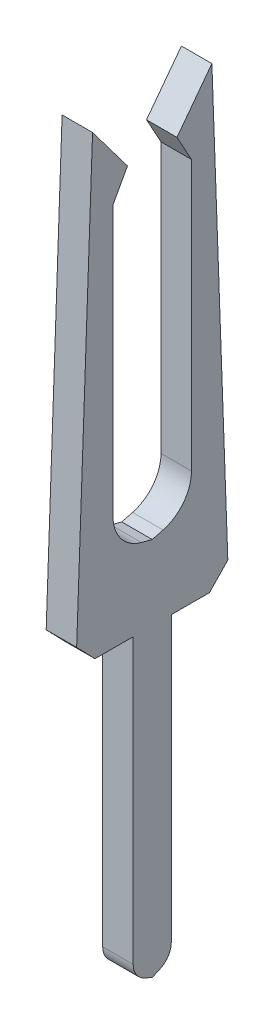
ISO-10303-21;
HEADER;
FILE_DESCRIPTION(('STEP AP214'),'2;1');
FILE_NAME('part.step','',(''),(''),'','','');
FILE_SCHEMA(('AUTOMOTIVE_DESIGN { 1 0 10303 214 1 1 1 1 }'));
ENDSEC;
DATA;
#1=APPLICATION_CONTEXT('core data for automotive mechanical design processes');
#2=APPLICATION_PROTOCOL_DEFINITION('international standard','automotive_design',2000,#1);
#3=PRODUCT_CONTEXT('',#1,'mechanical');
#4=PRODUCT('Part','Part','',(#3));
#5=PRODUCT_RELATED_PRODUCT_CATEGORY('part','',(#4));
#6=PRODUCT_DEFINITION_FORMATION('','',#4);
#7=PRODUCT_DEFINITION_CONTEXT('part definition',#1,'design');
#8=PRODUCT_DEFINITION('design','',#6,#7);
#9=PRODUCT_DEFINITION_SHAPE('','',#8);
#10=(LENGTH_UNIT() NAMED_UNIT(*) SI_UNIT(.MILLI.,.METRE.));
#11=(NAMED_UNIT(*) PLANE_ANGLE_UNIT() SI_UNIT($,.RADIAN.));
#12=(NAMED_UNIT(*) SI_UNIT($,.STERADIAN.) SOLID_ANGLE_UNIT());
#13=UNCERTAINTY_MEASURE_WITH_UNIT(LENGTH_MEASURE(1.E-05),#10,'distance_accuracy_value','');
#14=(GEOMETRIC_REPRESENTATION_CONTEXT(3) GLOBAL_UNCERTAINTY_ASSIGNED_CONTEXT((#13)) GLOBAL_UNIT_ASSIGNED_CONTEXT((#10,
#11,#12)) REPRESENTATION_CONTEXT('',''));
#15=CARTESIAN_POINT('',(0.,0.,0.));
#16=DIRECTION('',(0.,0.,1.));
#17=DIRECTION('',(1.,0.,0.));
#18=AXIS2_PLACEMENT_3D('',#15,#16,#17);
#19=CARTESIAN_POINT('',(0.4,2.15627423693323,0.277438328452502));
#20=DIRECTION('',(0.,0.694137309805425,0.71984261831048));
#21=DIRECTION('',(0.,-0.71984261831048,0.694137309805425));
#22=AXIS2_PLACEMENT_3D('',#19,#20,#21);
#23=PLANE('',#22);
#24=DIRECTION('',(0.,0.71984261831048,-0.694137309805425));
#25=VECTOR('',#24,1.);
#26=CARTESIAN_POINT('',(0.,2.15627423693323,0.277438328452502));
#27=LINE('',#26,#25);
#28=CARTESIAN_POINT('',(0.,1.90643942765456,0.518351630884458));
#29=VERTEX_POINT('',#28);
#30=CARTESIAN_POINT('',(0.,2.15627423693323,0.277438328452502));
#31=VERTEX_POINT('',#30);
#32=EDGE_CURVE('E222',#29,#31,#27,.T.);
#33=ORIENTED_EDGE('',*,*,#32,.T.);
#34=DIRECTION('',(-1.,0.,0.));
#35=VECTOR('',#34,1.);
#36=CARTESIAN_POINT('',(0.4,2.15627423693323,0.277438328452502));
#37=LINE('',#36,#35);
#38=CARTESIAN_POINT('',(0.4,2.15627423693323,0.277438328452502));
#39=VERTEX_POINT('',#38);
#40=EDGE_CURVE('E11',#39,#31,#37,.T.);
#41=ORIENTED_EDGE('',*,*,#40,.F.);
#42=DIRECTION('',(0.,0.71984261831048,-0.694137309805425));
#43=VECTOR('',#42,1.);
#44=CARTESIAN_POINT('',(0.4,2.15627423693323,0.277438328452502));
#45=LINE('',#44,#43);
#46=CARTESIAN_POINT('',(0.4,1.90643942765456,0.518351630884458));
#47=VERTEX_POINT('',#46);
#48=EDGE_CURVE('E268',#47,#39,#45,.T.);
#49=ORIENTED_EDGE('',*,*,#48,.F.);
#50=DIRECTION('',(-1.,0.,0.));
#51=VECTOR('',#50,1.);
#52=CARTESIAN_POINT('',(0.4,1.90643942765456,0.518351630884458));
#53=LINE('',#52,#51);
#54=EDGE_CURVE('E218',#47,#29,#53,.T.);
#55=ORIENTED_EDGE('',*,*,#54,.T.);
#56=EDGE_LOOP('',(#33,#41,#49,#55));
#57=FACE_BOUND('',#56,.T.);
#58=ADVANCED_FACE('F38',(#57),#23,.F.);
#59=CARTESIAN_POINT('',(0.4,7.90643942765456,0.486576567456251));
#60=DIRECTION('',(0.,-0.036346790272175,0.99933923711466));
#61=DIRECTION('',(0.,-0.99933923711466,-0.036346790272175));
#62=AXIS2_PLACEMENT_3D('',#59,#60,#61);
#63=PLANE('',#62);
#64=DIRECTION('',(0.,0.99933923711466,0.036346790272175));
#65=VECTOR('',#64,1.);
#66=CARTESIAN_POINT('',(0.,7.90643942765456,0.486576567456251));
#67=LINE('',#66,#65);
#68=CARTESIAN_POINT('',(0.,7.90643942765456,0.486576567456251));
#69=VERTEX_POINT('',#68);
#70=EDGE_CURVE('E225',#31,#69,#67,.T.);
#71=ORIENTED_EDGE('',*,*,#70,.T.);
#72=DIRECTION('',(-1.,0.,0.));
#73=VECTOR('',#72,1.);
#74=CARTESIAN_POINT('',(0.4,7.90643942765456,0.486576567456251));
#75=LINE('',#74,#73);
#76=CARTESIAN_POINT('',(0.4,7.90643942765456,0.486576567456251));
#77=VERTEX_POINT('',#76);
#78=EDGE_CURVE('E46',#77,#69,#75,.T.);
#79=ORIENTED_EDGE('',*,*,#78,.F.);
#80=DIRECTION('',(0.,0.99933923711466,0.036346790272175));
#81=VECTOR('',#80,1.);
#82=CARTESIAN_POINT('',(0.4,7.90643942765456,0.486576567456251));
#83=LINE('',#82,#81);
#84=EDGE_CURVE('E141',#39,#77,#83,.T.);
#85=ORIENTED_EDGE('',*,*,#84,.F.);
#86=ORIENTED_EDGE('',*,*,#40,.T.);
#87=EDGE_LOOP('',(#71,#79,#85,#86));
#88=FACE_BOUND('',#87,.T.);
#89=ADVANCED_FACE('F402',(#88),#63,.F.);
#90=CARTESIAN_POINT('',(0.4,7.29691604158744,0.944947879463951));
#91=DIRECTION('',(0.,-0.601030672473663,-0.799225957252301));
#92=DIRECTION('',(0.,0.799225957252301,-0.601030672473663));
#93=AXIS2_PLACEMENT_3D('',#90,#91,#92);
#94=PLANE('',#93);
#95=DIRECTION('',(0.,-0.799225957252301,0.601030672473663));
#96=VECTOR('',#95,1.);
#97=CARTESIAN_POINT('',(0.,7.29691604158744,0.944947879463951));
#98=LINE('',#97,#96);
#99=CARTESIAN_POINT('',(0.,7.29691604158744,0.944947879463951));
#100=VERTEX_POINT('',#99);
#101=EDGE_CURVE('E228',#69,#100,#98,.T.);
#102=ORIENTED_EDGE('',*,*,#101,.T.);
#103=DIRECTION('',(-1.,0.,0.));
#104=VECTOR('',#103,1.);
#105=CARTESIAN_POINT('',(0.4,7.29691604158744,0.944947879463951));
#106=LINE('',#105,#104);
#107=CARTESIAN_POINT('',(0.4,7.29691604158744,0.944947879463951));
#108=VERTEX_POINT('',#107);
#109=EDGE_CURVE('E318',#108,#100,#106,.T.);
#110=ORIENTED_EDGE('',*,*,#109,.F.);
#111=DIRECTION('',(0.,-0.799225957252301,0.601030672473663));
#112=VECTOR('',#111,1.);
#113=CARTESIAN_POINT('',(0.4,7.29691604158744,0.944947879463951));
#114=LINE('',#113,#112);
#115=EDGE_CURVE('E327',#77,#108,#114,.T.);
#116=ORIENTED_EDGE('',*,*,#115,.F.);
#117=ORIENTED_EDGE('',*,*,#78,.T.);
#118=EDGE_LOOP('',(#102,#110,#116,#117));
#119=FACE_BOUND('',#118,.T.);
#120=ADVANCED_FACE('F325',(#119),#94,.F.);
#121=CARTESIAN_POINT('',(0.4,6.95011825296304,0.754777343997982));
#122=DIRECTION('',(0.,0.480815317239039,-0.876821892238283));
#123=DIRECTION('',(0.,0.876821892238283,0.480815317239039));
#124=AXIS2_PLACEMENT_3D('',#121,#122,#123);
#125=PLANE('',#124);
#126=DIRECTION('',(0.,-0.876821892238283,-0.480815317239039));
#127=VECTOR('',#126,1.);
#128=CARTESIAN_POINT('',(0.,6.95011825296304,0.754777343997982));
#129=LINE('',#128,#127);
#130=CARTESIAN_POINT('',(0.,6.95011825296304,0.754777343997982));
#131=VERTEX_POINT('',#130);
#132=EDGE_CURVE('E231',#100,#131,#129,.T.);
#133=ORIENTED_EDGE('',*,*,#132,.T.);
#134=DIRECTION('',(-1.,0.,0.));
#135=VECTOR('',#134,1.);
#136=CARTESIAN_POINT('',(0.4,6.95011825296304,0.754777343997982));
#137=LINE('',#136,#135);
#138=CARTESIAN_POINT('',(0.4,6.95011825296304,0.754777343997982));
#139=VERTEX_POINT('',#138);
#140=EDGE_CURVE('E314',#139,#131,#137,.T.);
#141=ORIENTED_EDGE('',*,*,#140,.F.);
#142=DIRECTION('',(0.,-0.876821892238283,-0.480815317239039));
#143=VECTOR('',#142,1.);
#144=CARTESIAN_POINT('',(0.4,6.95011825296304,0.754777343997982));
#145=LINE('',#144,#143);
#146=EDGE_CURVE('E346',#108,#139,#145,.T.);
#147=ORIENTED_EDGE('',*,*,#146,.F.);
#148=ORIENTED_EDGE('',*,*,#109,.T.);
#149=EDGE_LOOP('',(#133,#141,#147,#148));
#150=FACE_BOUND('',#149,.T.);
#151=ADVANCED_FACE('F336',(#150),#125,.F.);
#152=CARTESIAN_POINT('',(0.4,3.40759606010662,0.754710604299908));
#153=DIRECTION('',(0.,1.88395991410638E-05,-0.999999999822535));
#154=DIRECTION('',(0.,0.999999999822535,1.88395991410638E-05));
#155=AXIS2_PLACEMENT_3D('',#152,#153,#154);
#156=PLANE('',#155);
#157=DIRECTION('',(0.,-0.999999999822535,-1.88395991410638E-05));
#158=VECTOR('',#157,1.);
#159=CARTESIAN_POINT('',(0.,3.40759606010662,0.754710604299908));
#160=LINE('',#159,#158);
#161=CARTESIAN_POINT('',(0.,3.40759606010662,0.754710604299908));
#162=VERTEX_POINT('',#161);
#163=EDGE_CURVE('E234',#131,#162,#160,.T.);
#164=ORIENTED_EDGE('',*,*,#163,.T.);
#165=DIRECTION('',(-1.,0.,0.));
#166=VECTOR('',#165,1.);
#167=CARTESIAN_POINT('',(0.4,3.40759606010662,0.754710604299908));
#168=LINE('',#167,#166);
#169=CARTESIAN_POINT('',(0.4,3.40759606010662,0.754710604299908));
#170=VERTEX_POINT('',#169);
#171=EDGE_CURVE('E311',#170,#162,#168,.T.);
#172=ORIENTED_EDGE('',*,*,#171,.F.);
#173=DIRECTION('',(0.,-0.999999999822535,-1.88395991410638E-05));
#174=VECTOR('',#173,1.);
#175=CARTESIAN_POINT('',(0.4,3.40759606010662,0.754710604299908));
#176=LINE('',#175,#174);
#177=EDGE_CURVE('E342',#139,#170,#176,.T.);
#178=ORIENTED_EDGE('',*,*,#177,.F.);
#179=ORIENTED_EDGE('',*,*,#140,.T.);
#180=EDGE_LOOP('',(#164,#172,#178,#179));
#181=FACE_BOUND('',#180,.T.);
#182=ADVANCED_FACE('F340',(#181),#156,.F.);
#183=CARTESIAN_POINT('',(0.4,3.40758664030705,1.25471060421118));
#184=DIRECTION('',(-1.,0.,0.));
#185=DIRECTION('',(0.,0.,1.));
#186=AXIS2_PLACEMENT_3D('',#183,#184,#185);
#187=CYLINDRICAL_SURFACE('',#186,0.5);
#188=CARTESIAN_POINT('',(0.,3.40758664030705,1.25471060421118));
#189=DIRECTION('',(-1.,0.,0.));
#190=DIRECTION('',(0.,0.,-1.));
#191=AXIS2_PLACEMENT_3D('',#188,#189,#190);
#192=CIRCLE('',#191,0.5);
#193=CARTESIAN_POINT('',(0.,2.92391221511593,1.127986295509));
#194=VERTEX_POINT('',#193);
#195=EDGE_CURVE('E237',#162,#194,#192,.T.);
#196=ORIENTED_EDGE('',*,*,#195,.T.);
#197=DIRECTION('',(-1.,0.,0.));
#198=VECTOR('',#197,1.);
#199=CARTESIAN_POINT('',(0.4,2.92391221511593,1.127986295509));
#200=LINE('',#199,#198);
#201=CARTESIAN_POINT('',(0.4,2.92391221511593,1.127986295509));
#202=VERTEX_POINT('',#201);
#203=EDGE_CURVE('E308',#202,#194,#200,.T.);
#204=ORIENTED_EDGE('',*,*,#203,.F.);
#205=CARTESIAN_POINT('',(0.4,3.40758664030705,1.25471060421118));
#206=DIRECTION('',(-1.,0.,0.));
#207=DIRECTION('',(0.,0.,-1.));
#208=AXIS2_PLACEMENT_3D('',#205,#206,#207);
#209=CIRCLE('',#208,0.5);
#210=EDGE_CURVE('E345',#170,#202,#209,.T.);
#211=ORIENTED_EDGE('',*,*,#210,.F.);
#212=ORIENTED_EDGE('',*,*,#171,.T.);
#213=EDGE_LOOP('',(#196,#204,#211,#212));
#214=FACE_BOUND('',#213,.T.);
#215=ADVANCED_FACE('F415',(#214),#187,.F.);
#216=CARTESIAN_POINT('',(0.4,2.88671780777912,1.26994787946395));
#217=DIRECTION('',(0.,-0.967348850382229,-0.253448617404358));
#218=DIRECTION('',(0.,0.253448617404358,-0.967348850382229));
#219=AXIS2_PLACEMENT_3D('',#216,#217,#218);
#220=PLANE('',#219);
#221=DIRECTION('',(0.,-0.253448617404358,0.967348850382229));
#222=VECTOR('',#221,1.);
#223=CARTESIAN_POINT('',(0.,2.88671780777912,1.26994787946395));
#224=LINE('',#223,#222);
#225=CARTESIAN_POINT('',(0.,2.88671780777912,1.26994787946395));
#226=VERTEX_POINT('',#225);
#227=EDGE_CURVE('E239',#194,#226,#224,.T.);
#228=ORIENTED_EDGE('',*,*,#227,.T.);
#229=DIRECTION('',(-1.,0.,0.));
#230=VECTOR('',#229,1.);
#231=CARTESIAN_POINT('',(0.4,2.88671780777912,1.26994787946395));
#232=LINE('',#231,#230);
#233=CARTESIAN_POINT('',(0.4,2.88671780777912,1.26994787946395));
#234=VERTEX_POINT('',#233);
#235=EDGE_CURVE('E305',#234,#226,#232,.T.);
#236=ORIENTED_EDGE('',*,*,#235,.F.);
#237=DIRECTION('',(0.,-0.253448617404358,0.967348850382229));
#238=VECTOR('',#237,1.);
#239=CARTESIAN_POINT('',(0.4,2.88671780777912,1.26994787946395));
#240=LINE('',#239,#238);
#241=EDGE_CURVE('E349',#202,#234,#240,.T.);
#242=ORIENTED_EDGE('',*,*,#241,.F.);
#243=ORIENTED_EDGE('',*,*,#203,.T.);
#244=EDGE_LOOP('',(#228,#236,#242,#243));
#245=FACE_BOUND('',#244,.T.);
#246=ADVANCED_FACE('F418',(#245),#220,.F.);
#247=CARTESIAN_POINT('',(0.4,2.88671780777912,1.26994787946395));
#248=DIRECTION('',(0.,-0.967348850382229,0.253448617404358));
#249=DIRECTION('',(0.,-0.253448617404358,-0.967348850382229));
#250=AXIS2_PLACEMENT_3D('',#247,#248,#249);
#251=PLANE('',#250);
#252=DIRECTION('',(0.,0.253448617404358,0.967348850382229));
#253=VECTOR('',#252,1.);
#254=CARTESIAN_POINT('',(0.,2.88671780777912,1.26994787946395));
#255=LINE('',#254,#253);
#256=CARTESIAN_POINT('',(0.,2.92391221511593,1.4119094634189));
#257=VERTEX_POINT('',#256);
#258=EDGE_CURVE('E241',#226,#257,#255,.T.);
#259=ORIENTED_EDGE('',*,*,#258,.T.);
#260=DIRECTION('',(-1.,0.,0.));
#261=VECTOR('',#260,1.);
#262=CARTESIAN_POINT('',(0.4,2.92391221511593,1.4119094634189));
#263=LINE('',#262,#261);
#264=CARTESIAN_POINT('',(0.4,2.92391221511593,1.4119094634189));
#265=VERTEX_POINT('',#264);
#266=EDGE_CURVE('E302',#265,#257,#263,.T.);
#267=ORIENTED_EDGE('',*,*,#266,.F.);
#268=DIRECTION('',(0.,0.253448617404358,0.967348850382229));
#269=VECTOR('',#268,1.);
#270=CARTESIAN_POINT('',(0.4,2.88671780777912,1.26994787946395));
#271=LINE('',#270,#269);
#272=EDGE_CURVE('E356',#234,#265,#271,.T.);
#273=ORIENTED_EDGE('',*,*,#272,.F.);
#274=ORIENTED_EDGE('',*,*,#235,.T.);
#275=EDGE_LOOP('',(#259,#267,#273,#274));
#276=FACE_BOUND('',#275,.T.);
#277=ADVANCED_FACE('F422',(#276),#251,.F.);
#278=CARTESIAN_POINT('',(0.4,3.40758664030705,1.28518515471672));
#279=DIRECTION('',(-1.,0.,0.));
#280=DIRECTION('',(0.,0.,1.));
#281=AXIS2_PLACEMENT_3D('',#278,#279,#280);
#282=CYLINDRICAL_SURFACE('',#281,0.5);
#283=CARTESIAN_POINT('',(0.,3.40758664030705,1.28518515471672));
#284=DIRECTION('',(-1.,0.,0.));
#285=DIRECTION('',(0.,0.,1.));
#286=AXIS2_PLACEMENT_3D('',#283,#284,#285);
#287=CIRCLE('',#286,0.5);
#288=CARTESIAN_POINT('',(0.,3.40759606010662,1.78518515462799));
#289=VERTEX_POINT('',#288);
#290=EDGE_CURVE('E243',#257,#289,#287,.T.);
#291=ORIENTED_EDGE('',*,*,#290,.T.);
#292=DIRECTION('',(-1.,0.,0.));
#293=VECTOR('',#292,1.);
#294=CARTESIAN_POINT('',(0.4,3.40759606010662,1.78518515462799));
#295=LINE('',#294,#293);
#296=CARTESIAN_POINT('',(0.4,3.40759606010662,1.78518515462799));
#297=VERTEX_POINT('',#296);
#298=EDGE_CURVE('E299',#297,#289,#295,.T.);
#299=ORIENTED_EDGE('',*,*,#298,.F.);
#300=CARTESIAN_POINT('',(0.4,3.40758664030705,1.28518515471672));
#301=DIRECTION('',(-1.,0.,0.));
#302=DIRECTION('',(0.,0.,1.));
#303=AXIS2_PLACEMENT_3D('',#300,#301,#302);
#304=CIRCLE('',#303,0.5);
#305=EDGE_CURVE('E358',#265,#297,#304,.T.);
#306=ORIENTED_EDGE('',*,*,#305,.F.);
#307=ORIENTED_EDGE('',*,*,#266,.T.);
#308=EDGE_LOOP('',(#291,#299,#306,#307));
#309=FACE_BOUND('',#308,.T.);
#310=ADVANCED_FACE('F426',(#309),#282,.F.);
#311=CARTESIAN_POINT('',(0.4,3.40759606010662,1.78518515462799));
#312=DIRECTION('',(0.,1.88395991408802E-05,0.999999999822535));
#313=DIRECTION('',(0.,-0.999999999822535,1.88395991408802E-05));
#314=AXIS2_PLACEMENT_3D('',#311,#312,#313);
#315=PLANE('',#314);
#316=DIRECTION('',(0.,0.999999999822535,-1.88395991408802E-05));
#317=VECTOR('',#316,1.);
#318=CARTESIAN_POINT('',(0.,3.40759606010662,1.78518515462799));
#319=LINE('',#318,#317);
#320=CARTESIAN_POINT('',(0.,6.95011825296304,1.78511841492992));
#321=VERTEX_POINT('',#320);
#322=EDGE_CURVE('E245',#289,#321,#319,.T.);
#323=ORIENTED_EDGE('',*,*,#322,.T.);
#324=DIRECTION('',(-1.,0.,0.));
#325=VECTOR('',#324,1.);
#326=CARTESIAN_POINT('',(0.4,6.95011825296304,1.78511841492992));
#327=LINE('',#326,#325);
#328=CARTESIAN_POINT('',(0.4,6.95011825296304,1.78511841492992));
#329=VERTEX_POINT('',#328);
#330=EDGE_CURVE('E296',#329,#321,#327,.T.);
#331=ORIENTED_EDGE('',*,*,#330,.F.);
#332=DIRECTION('',(0.,0.999999999822535,-1.88395991408802E-05));
#333=VECTOR('',#332,1.);
#334=CARTESIAN_POINT('',(0.4,3.40759606010662,1.78518515462799));
#335=LINE('',#334,#333);
#336=EDGE_CURVE('E360',#297,#329,#335,.T.);
#337=ORIENTED_EDGE('',*,*,#336,.F.);
#338=ORIENTED_EDGE('',*,*,#298,.T.);
#339=EDGE_LOOP('',(#323,#331,#337,#338));
#340=FACE_BOUND('',#339,.T.);
#341=ADVANCED_FACE('F430',(#340),#315,.F.);
#342=CARTESIAN_POINT('',(0.4,6.95011825296304,1.78511841492992));
#343=DIRECTION('',(0.,0.480815317239038,0.876821892238283));
#344=DIRECTION('',(0.,-0.876821892238283,0.480815317239038));
#345=AXIS2_PLACEMENT_3D('',#342,#343,#344);
#346=PLANE('',#345);
#347=DIRECTION('',(0.,0.876821892238283,-0.480815317239038));
#348=VECTOR('',#347,1.);
#349=CARTESIAN_POINT('',(0.,6.95011825296304,1.78511841492992));
#350=LINE('',#349,#348);
#351=CARTESIAN_POINT('',(0.,7.29691604158744,1.59494787946395));
#352=VERTEX_POINT('',#351);
#353=EDGE_CURVE('E247',#321,#352,#350,.T.);
#354=ORIENTED_EDGE('',*,*,#353,.T.);
#355=DIRECTION('',(-1.,0.,0.));
#356=VECTOR('',#355,1.);
#357=CARTESIAN_POINT('',(0.4,7.29691604158744,1.59494787946395));
#358=LINE('',#357,#356);
#359=CARTESIAN_POINT('',(0.4,7.29691604158744,1.59494787946395));
#360=VERTEX_POINT('',#359);
#361=EDGE_CURVE('E293',#360,#352,#358,.T.);
#362=ORIENTED_EDGE('',*,*,#361,.F.);
#363=DIRECTION('',(0.,0.876821892238283,-0.480815317239038));
#364=VECTOR('',#363,1.);
#365=CARTESIAN_POINT('',(0.4,6.95011825296304,1.78511841492992));
#366=LINE('',#365,#364);
#367=EDGE_CURVE('E362',#329,#360,#366,.T.);
#368=ORIENTED_EDGE('',*,*,#367,.F.);
#369=ORIENTED_EDGE('',*,*,#330,.T.);
#370=EDGE_LOOP('',(#354,#362,#368,#369));
#371=FACE_BOUND('',#370,.T.);
#372=ADVANCED_FACE('F434',(#371),#346,.F.);
#373=CARTESIAN_POINT('',(0.4,7.29691604158744,1.59494787946395));
#374=DIRECTION('',(0.,-0.601030672473662,0.799225957252301));
#375=DIRECTION('',(0.,-0.799225957252301,-0.601030672473662));
#376=AXIS2_PLACEMENT_3D('',#373,#374,#375);
#377=PLANE('',#376);
#378=DIRECTION('',(0.,0.799225957252301,0.601030672473662));
#379=VECTOR('',#378,1.);
#380=CARTESIAN_POINT('',(0.,7.29691604158744,1.59494787946395));
#381=LINE('',#380,#379);
#382=CARTESIAN_POINT('',(0.,7.90643942765456,2.05331919147165));
#383=VERTEX_POINT('',#382);
#384=EDGE_CURVE('E249',#352,#383,#381,.T.);
#385=ORIENTED_EDGE('',*,*,#384,.T.);
#386=DIRECTION('',(-1.,0.,0.));
#387=VECTOR('',#386,1.);
#388=CARTESIAN_POINT('',(0.4,7.90643942765456,2.05331919147165));
#389=LINE('',#388,#387);
#390=CARTESIAN_POINT('',(0.4,7.90643942765456,2.05331919147165));
#391=VERTEX_POINT('',#390);
#392=EDGE_CURVE('E290',#391,#383,#389,.T.);
#393=ORIENTED_EDGE('',*,*,#392,.F.);
#394=DIRECTION('',(0.,0.799225957252301,0.601030672473662));
#395=VECTOR('',#394,1.);
#396=CARTESIAN_POINT('',(0.4,7.29691604158744,1.59494787946395));
#397=LINE('',#396,#395);
#398=EDGE_CURVE('E364',#360,#391,#397,.T.);
#399=ORIENTED_EDGE('',*,*,#398,.F.);
#400=ORIENTED_EDGE('',*,*,#361,.T.);
#401=EDGE_LOOP('',(#385,#393,#399,#400));
#402=FACE_BOUND('',#401,.T.);
#403=ADVANCED_FACE('F438',(#402),#377,.F.);
#404=CARTESIAN_POINT('',(0.4,7.90643942765456,2.05331919147165));
#405=DIRECTION('',(0.,-0.0363467902721749,-0.99933923711466));
#406=DIRECTION('',(0.,0.99933923711466,-0.0363467902721749));
#407=AXIS2_PLACEMENT_3D('',#404,#405,#406);
#408=PLANE('',#407);
#409=DIRECTION('',(0.,-0.99933923711466,0.0363467902721749));
#410=VECTOR('',#409,1.);
#411=CARTESIAN_POINT('',(0.,7.90643942765456,2.05331919147165));
#412=LINE('',#411,#410);
#413=CARTESIAN_POINT('',(0.,2.15627423693323,2.26245743047539));
#414=VERTEX_POINT('',#413);
#415=EDGE_CURVE('E251',#383,#414,#412,.T.);
#416=ORIENTED_EDGE('',*,*,#415,.T.);
#417=DIRECTION('',(-1.,0.,0.));
#418=VECTOR('',#417,1.);
#419=CARTESIAN_POINT('',(0.4,2.15627423693323,2.26245743047539));
#420=LINE('',#419,#418);
#421=CARTESIAN_POINT('',(0.4,2.15627423693323,2.26245743047539));
#422=VERTEX_POINT('',#421);
#423=EDGE_CURVE('E287',#422,#414,#420,.T.);
#424=ORIENTED_EDGE('',*,*,#423,.F.);
#425=DIRECTION('',(0.,-0.99933923711466,0.0363467902721749));
#426=VECTOR('',#425,1.);
#427=CARTESIAN_POINT('',(0.4,7.90643942765456,2.05331919147165));
#428=LINE('',#427,#426);
#429=EDGE_CURVE('E366',#391,#422,#428,.T.);
#430=ORIENTED_EDGE('',*,*,#429,.F.);
#431=ORIENTED_EDGE('',*,*,#392,.T.);
#432=EDGE_LOOP('',(#416,#424,#430,#431));
#433=FACE_BOUND('',#432,.T.);
#434=ADVANCED_FACE('F442',(#433),#408,.F.);
#435=CARTESIAN_POINT('',(0.4,2.15627423693323,2.26245743047539));
#436=DIRECTION('',(0.,0.694137309805425,-0.71984261831048));
#437=DIRECTION('',(0.,0.71984261831048,0.694137309805426));
#438=AXIS2_PLACEMENT_3D('',#435,#436,#437);
#439=PLANE('',#438);
#440=DIRECTION('',(0.,-0.71984261831048,-0.694137309805426));
#441=VECTOR('',#440,1.);
#442=CARTESIAN_POINT('',(0.,2.15627423693323,2.26245743047539));
#443=LINE('',#442,#441);
#444=CARTESIAN_POINT('',(0.,1.90643942765456,2.02154412804344));
#445=VERTEX_POINT('',#444);
#446=EDGE_CURVE('E253',#414,#445,#443,.T.);
#447=ORIENTED_EDGE('',*,*,#446,.T.);
#448=DIRECTION('',(-1.,0.,0.));
#449=VECTOR('',#448,1.);
#450=CARTESIAN_POINT('',(0.4,1.90643942765456,2.02154412804344));
#451=LINE('',#450,#449);
#452=CARTESIAN_POINT('',(0.4,1.90643942765456,2.02154412804344));
#453=VERTEX_POINT('',#452);
#454=EDGE_CURVE('E284',#453,#445,#451,.T.);
#455=ORIENTED_EDGE('',*,*,#454,.F.);
#456=DIRECTION('',(0.,-0.71984261831048,-0.694137309805426));
#457=VECTOR('',#456,1.);
#458=CARTESIAN_POINT('',(0.4,2.15627423693323,2.26245743047539));
#459=LINE('',#458,#457);
#460=EDGE_CURVE('E369',#422,#453,#459,.T.);
#461=ORIENTED_EDGE('',*,*,#460,.F.);
#462=ORIENTED_EDGE('',*,*,#423,.T.);
#463=EDGE_LOOP('',(#447,#455,#461,#462));
#464=FACE_BOUND('',#463,.T.);
#465=ADVANCED_FACE('F446',(#464),#439,.F.);
#466=CARTESIAN_POINT('',(0.4,1.90643942765456,2.02154412804344));
#467=DIRECTION('',(0.,1.,0.));
#468=DIRECTION('',(0.,0.,1.));
#469=AXIS2_PLACEMENT_3D('',#466,#467,#468);
#470=PLANE('',#469);
#471=DIRECTION('',(0.,0.,-1.));
#472=VECTOR('',#471,1.);
#473=CARTESIAN_POINT('',(0.,1.90643942765456,2.02154412804344));
#474=LINE('',#473,#472);
#475=CARTESIAN_POINT('',(0.,1.90643942765456,1.51994787946395));
#476=VERTEX_POINT('',#475);
#477=EDGE_CURVE('E255',#445,#476,#474,.T.);
#478=ORIENTED_EDGE('',*,*,#477,.T.);
#479=DIRECTION('',(-1.,0.,0.));
#480=VECTOR('',#479,1.);
#481=CARTESIAN_POINT('',(0.4,1.90643942765456,1.51994787946395));
#482=LINE('',#481,#480);
#483=CARTESIAN_POINT('',(0.4,1.90643942765456,1.51994787946395));
#484=VERTEX_POINT('',#483);
#485=EDGE_CURVE('E281',#484,#476,#482,.T.);
#486=ORIENTED_EDGE('',*,*,#485,.F.);
#487=DIRECTION('',(0.,0.,-1.));
#488=VECTOR('',#487,1.);
#489=CARTESIAN_POINT('',(0.4,1.90643942765456,2.02154412804344));
#490=LINE('',#489,#488);
#491=EDGE_CURVE('E371',#453,#484,#490,.T.);
#492=ORIENTED_EDGE('',*,*,#491,.F.);
#493=ORIENTED_EDGE('',*,*,#454,.T.);
#494=EDGE_LOOP('',(#478,#486,#492,#493));
#495=FACE_BOUND('',#494,.T.);
#496=ADVANCED_FACE('F450',(#495),#470,.F.);
#497=CARTESIAN_POINT('',(0.4,1.90643942765456,1.51994787946395));
#498=DIRECTION('',(0.,0.,-1.));
#499=DIRECTION('',(0.,1.,0.));
#500=AXIS2_PLACEMENT_3D('',#497,#498,#499);
#501=PLANE('',#500);
#502=DIRECTION('',(0.,-1.,0.));
#503=VECTOR('',#502,1.);
#504=CARTESIAN_POINT('',(0.,1.90643942765456,1.51994787946395));
#505=LINE('',#504,#503);
#506=CARTESIAN_POINT('',(0.,-1.82003778744792,1.51994787946395));
#507=VERTEX_POINT('',#506);
#508=EDGE_CURVE('E257',#476,#507,#505,.T.);
#509=ORIENTED_EDGE('',*,*,#508,.T.);
#510=DIRECTION('',(-1.,0.,0.));
#511=VECTOR('',#510,1.);
#512=CARTESIAN_POINT('',(0.4,-1.82003778744792,1.51994787946395));
#513=LINE('',#512,#511);
#514=CARTESIAN_POINT('',(0.4,-1.82003778744792,1.51994787946395));
#515=VERTEX_POINT('',#514);
#516=EDGE_CURVE('E278',#515,#507,#513,.T.);
#517=ORIENTED_EDGE('',*,*,#516,.F.);
#518=DIRECTION('',(0.,-1.,0.));
#519=VECTOR('',#518,1.);
#520=CARTESIAN_POINT('',(0.4,1.90643942765456,1.51994787946395));
#521=LINE('',#520,#519);
#522=EDGE_CURVE('E373',#484,#515,#521,.T.);
#523=ORIENTED_EDGE('',*,*,#522,.F.);
#524=ORIENTED_EDGE('',*,*,#485,.T.);
#525=EDGE_LOOP('',(#509,#517,#523,#524));
#526=FACE_BOUND('',#525,.T.);
#527=ADVANCED_FACE('F454',(#526),#501,.F.);
#528=CARTESIAN_POINT('',(0.4,-1.82003778744792,1.26994787946395));
#529=DIRECTION('',(-1.,0.,0.));
#530=DIRECTION('',(0.,0.,1.));
#531=AXIS2_PLACEMENT_3D('',#528,#529,#530);
#532=CYLINDRICAL_SURFACE('',#531,0.249999999999999);
#533=CARTESIAN_POINT('',(0.,-1.82003778744792,1.26994787946395));
#534=DIRECTION('',(1.,0.,0.));
#535=DIRECTION('',(0.,0.,-1.));
#536=AXIS2_PLACEMENT_3D('',#533,#534,#535);
#537=CIRCLE('',#536,0.249999999999999);
#538=CARTESIAN_POINT('',(0.,-2.04853794703578,1.37137606621853));
#539=VERTEX_POINT('',#538);
#540=EDGE_CURVE('E259',#507,#539,#537,.T.);
#541=ORIENTED_EDGE('',*,*,#540,.T.);
#542=DIRECTION('',(-1.,0.,0.));
#543=VECTOR('',#542,1.);
#544=CARTESIAN_POINT('',(0.4,-2.04853794703578,1.37137606621853));
#545=LINE('',#544,#543);
#546=CARTESIAN_POINT('',(0.4,-2.04853794703578,1.37137606621853));
#547=VERTEX_POINT('',#546);
#548=EDGE_CURVE('E275',#547,#539,#545,.T.);
#549=ORIENTED_EDGE('',*,*,#548,.F.);
#550=CARTESIAN_POINT('',(0.4,-1.82003778744792,1.26994787946395));
#551=DIRECTION('',(1.,0.,0.));
#552=DIRECTION('',(0.,0.,-1.));
#553=AXIS2_PLACEMENT_3D('',#550,#551,#552);
#554=CIRCLE('',#553,0.249999999999999);
#555=EDGE_CURVE('E375',#515,#547,#554,.T.);
#556=ORIENTED_EDGE('',*,*,#555,.F.);
#557=ORIENTED_EDGE('',*,*,#516,.T.);
#558=EDGE_LOOP('',(#541,#549,#556,#557));
#559=FACE_BOUND('',#558,.T.);
#560=ADVANCED_FACE('F458',(#559),#532,.T.);
#561=CARTESIAN_POINT('',(0.4,-2.04853794703578,1.37137606621853));
#562=DIRECTION('',(0.,0.914000638351446,-0.405712747018317));
#563=DIRECTION('',(0.,0.405712747018317,0.914000638351446));
#564=AXIS2_PLACEMENT_3D('',#561,#562,#563);
#565=PLANE('',#564);
#566=DIRECTION('',(0.,-0.405712747018317,-0.914000638351446));
#567=VECTOR('',#566,1.);
#568=CARTESIAN_POINT('',(0.,-2.04853794703578,1.37137606621853));
#569=LINE('',#568,#567);
#570=CARTESIAN_POINT('',(0.,-2.09356057234545,1.26994787946395));
#571=VERTEX_POINT('',#570);
#572=EDGE_CURVE('E261',#539,#571,#569,.T.);
#573=ORIENTED_EDGE('',*,*,#572,.T.);
#574=DIRECTION('',(-1.,0.,0.));
#575=VECTOR('',#574,1.);
#576=CARTESIAN_POINT('',(0.4,-2.09356057234545,1.26994787946395));
#577=LINE('',#576,#575);
#578=CARTESIAN_POINT('',(0.4,-2.09356057234545,1.26994787946395));
#579=VERTEX_POINT('',#578);
#580=EDGE_CURVE('E272',#579,#571,#577,.T.);
#581=ORIENTED_EDGE('',*,*,#580,.F.);
#582=DIRECTION('',(0.,-0.405712747018317,-0.914000638351446));
#583=VECTOR('',#582,1.);
#584=CARTESIAN_POINT('',(0.4,-2.04853794703578,1.37137606621853));
#585=LINE('',#584,#583);
#586=EDGE_CURVE('E377',#547,#579,#585,.T.);
#587=ORIENTED_EDGE('',*,*,#586,.F.);
#588=ORIENTED_EDGE('',*,*,#548,.T.);
#589=EDGE_LOOP('',(#573,#581,#587,#588));
#590=FACE_BOUND('',#589,.T.);
#591=ADVANCED_FACE('F383',(#590),#565,.F.);
#592=CARTESIAN_POINT('',(0.4,-2.04853794703579,1.16851969270938));
#593=DIRECTION('',(0.,0.914000638351438,0.405712747018336));
#594=DIRECTION('',(0.,-0.405712747018336,0.914000638351438));
#595=AXIS2_PLACEMENT_3D('',#592,#593,#594);
#596=PLANE('',#595);
#597=DIRECTION('',(0.,0.405712747018336,-0.914000638351438));
#598=VECTOR('',#597,1.);
#599=CARTESIAN_POINT('',(0.,-2.04853794703579,1.16851969270938));
#600=LINE('',#599,#598);
#601=CARTESIAN_POINT('',(0.,-2.04853794703579,1.16851969270938));
#602=VERTEX_POINT('',#601);
#603=EDGE_CURVE('E263',#571,#602,#600,.T.);
#604=ORIENTED_EDGE('',*,*,#603,.T.);
#605=DIRECTION('',(-1.,0.,0.));
#606=VECTOR('',#605,1.);
#607=CARTESIAN_POINT('',(0.4,-2.04853794703579,1.16851969270938));
#608=LINE('',#607,#606);
#609=CARTESIAN_POINT('',(0.4,-2.04853794703579,1.16851969270938));
#610=VERTEX_POINT('',#609);
#611=EDGE_CURVE('E213',#610,#602,#608,.T.);
#612=ORIENTED_EDGE('',*,*,#611,.F.);
#613=DIRECTION('',(0.,0.405712747018336,-0.914000638351438));
#614=VECTOR('',#613,1.);
#615=CARTESIAN_POINT('',(0.4,-2.04853794703579,1.16851969270938));
#616=LINE('',#615,#614);
#617=EDGE_CURVE('E204',#579,#610,#616,.T.);
#618=ORIENTED_EDGE('',*,*,#617,.F.);
#619=ORIENTED_EDGE('',*,*,#580,.T.);
#620=EDGE_LOOP('',(#604,#612,#618,#619));
#621=FACE_BOUND('',#620,.T.);
#622=ADVANCED_FACE('F387',(#621),#596,.F.);
#623=CARTESIAN_POINT('',(0.4,-1.82003778744792,1.26994787946395));
#624=DIRECTION('',(-1.,0.,0.));
#625=DIRECTION('',(0.,0.,1.));
#626=AXIS2_PLACEMENT_3D('',#623,#624,#625);
#627=CYLINDRICAL_SURFACE('',#626,0.25);
#628=CARTESIAN_POINT('',(0.,-1.82003778744792,1.26994787946395));
#629=DIRECTION('',(1.,0.,0.));
#630=DIRECTION('',(0.,0.,1.));
#631=AXIS2_PLACEMENT_3D('',#628,#629,#630);
#632=CIRCLE('',#631,0.25);
#633=CARTESIAN_POINT('',(0.,-1.82003778744792,1.01994787946395));
#634=VERTEX_POINT('',#633);
#635=EDGE_CURVE('E212',#602,#634,#632,.T.);
#636=ORIENTED_EDGE('',*,*,#635,.T.);
#637=DIRECTION('',(-1.,0.,0.));
#638=VECTOR('',#637,1.);
#639=CARTESIAN_POINT('',(0.4,-1.82003778744792,1.01994787946395));
#640=LINE('',#639,#638);
#641=CARTESIAN_POINT('',(0.4,-1.82003778744792,1.01994787946395));
#642=VERTEX_POINT('',#641);
#643=EDGE_CURVE('E209',#642,#634,#640,.T.);
#644=ORIENTED_EDGE('',*,*,#643,.F.);
#645=CARTESIAN_POINT('',(0.4,-1.82003778744792,1.26994787946395));
#646=DIRECTION('',(1.,0.,0.));
#647=DIRECTION('',(0.,0.,1.));
#648=AXIS2_PLACEMENT_3D('',#645,#646,#647);
#649=CIRCLE('',#648,0.25);
#650=EDGE_CURVE('E198',#610,#642,#649,.T.);
#651=ORIENTED_EDGE('',*,*,#650,.F.);
#652=ORIENTED_EDGE('',*,*,#611,.T.);
#653=EDGE_LOOP('',(#636,#644,#651,#652));
#654=FACE_BOUND('',#653,.T.);
#655=ADVANCED_FACE('F210',(#654),#627,.T.);
#656=CARTESIAN_POINT('',(0.4,1.90643942765456,1.01994787946395));
#657=DIRECTION('',(0.,0.,1.));
#658=DIRECTION('',(1.,0.,0.));
#659=AXIS2_PLACEMENT_3D('',#656,#657,#658);
#660=PLANE('',#659);
#661=DIRECTION('',(0.,1.,0.));
#662=VECTOR('',#661,1.);
#663=CARTESIAN_POINT('',(0.,1.90643942765456,1.01994787946395));
#664=LINE('',#663,#662);
#665=CARTESIAN_POINT('',(0.,1.90643942765456,1.01994787946395));
#666=VERTEX_POINT('',#665);
#667=EDGE_CURVE('E127',#634,#666,#664,.T.);
#668=ORIENTED_EDGE('',*,*,#667,.T.);
#669=DIRECTION('',(-1.,0.,0.));
#670=VECTOR('',#669,1.);
#671=CARTESIAN_POINT('',(0.4,1.90643942765456,1.01994787946395));
#672=LINE('',#671,#670);
#673=CARTESIAN_POINT('',(0.4,1.90643942765456,1.01994787946395));
#674=VERTEX_POINT('',#673);
#675=EDGE_CURVE('E214',#674,#666,#672,.T.);
#676=ORIENTED_EDGE('',*,*,#675,.F.);
#677=DIRECTION('',(0.,1.,0.));
#678=VECTOR('',#677,1.);
#679=CARTESIAN_POINT('',(0.4,1.90643942765456,1.01994787946395));
#680=LINE('',#679,#678);
#681=EDGE_CURVE('E202',#642,#674,#680,.T.);
#682=ORIENTED_EDGE('',*,*,#681,.F.);
#683=ORIENTED_EDGE('',*,*,#643,.T.);
#684=EDGE_LOOP('',(#668,#676,#682,#683));
#685=FACE_BOUND('',#684,.T.);
#686=ADVANCED_FACE('F216',(#685),#660,.F.);
#687=CARTESIAN_POINT('',(0.4,1.90643942765456,0.518351630884458));
#688=DIRECTION('',(0.,1.,0.));
#689=DIRECTION('',(0.,0.,1.));
#690=AXIS2_PLACEMENT_3D('',#687,#688,#689);
#691=PLANE('',#690);
#692=DIRECTION('',(0.,0.,-1.));
#693=VECTOR('',#692,1.);
#694=CARTESIAN_POINT('',(0.,1.90643942765456,0.518351630884458));
#695=LINE('',#694,#693);
#696=EDGE_CURVE('E133',#666,#29,#695,.T.);
#697=ORIENTED_EDGE('',*,*,#696,.T.);
#698=ORIENTED_EDGE('',*,*,#54,.F.);
#699=DIRECTION('',(0.,0.,-1.));
#700=VECTOR('',#699,1.);
#701=CARTESIAN_POINT('',(0.4,1.90643942765456,0.518351630884458));
#702=LINE('',#701,#700);
#703=EDGE_CURVE('E54',#674,#47,#702,.T.);
#704=ORIENTED_EDGE('',*,*,#703,.F.);
#705=ORIENTED_EDGE('',*,*,#675,.T.);
#706=EDGE_LOOP('',(#697,#698,#704,#705));
#707=FACE_BOUND('',#706,.T.);
#708=ADVANCED_FACE('F391',(#707),#691,.F.);
#709=CARTESIAN_POINT('',(0.4,-1.82003778744792,1.26994787946395));
#710=DIRECTION('',(-1.,0.,0.));
#711=DIRECTION('',(0.,0.,1.));
#712=AXIS2_PLACEMENT_3D('',#709,#710,#711);
#713=PLANE('',#712);
#714=ORIENTED_EDGE('',*,*,#48,.T.);
#715=ORIENTED_EDGE('',*,*,#84,.T.);
#716=ORIENTED_EDGE('',*,*,#115,.T.);
#717=ORIENTED_EDGE('',*,*,#146,.T.);
#718=ORIENTED_EDGE('',*,*,#177,.T.);
#719=ORIENTED_EDGE('',*,*,#210,.T.);
#720=ORIENTED_EDGE('',*,*,#241,.T.);
#721=ORIENTED_EDGE('',*,*,#272,.T.);
#722=ORIENTED_EDGE('',*,*,#305,.T.);
#723=ORIENTED_EDGE('',*,*,#336,.T.);
#724=ORIENTED_EDGE('',*,*,#367,.T.);
#725=ORIENTED_EDGE('',*,*,#398,.T.);
#726=ORIENTED_EDGE('',*,*,#429,.T.);
#727=ORIENTED_EDGE('',*,*,#460,.T.);
#728=ORIENTED_EDGE('',*,*,#491,.T.);
#729=ORIENTED_EDGE('',*,*,#522,.T.);
#730=ORIENTED_EDGE('',*,*,#555,.T.);
#731=ORIENTED_EDGE('',*,*,#586,.T.);
#732=ORIENTED_EDGE('',*,*,#617,.T.);
#733=ORIENTED_EDGE('',*,*,#650,.T.);
#734=ORIENTED_EDGE('',*,*,#681,.T.);
#735=ORIENTED_EDGE('',*,*,#703,.T.);
#736=EDGE_LOOP('',(#714,#715,#716,#717,#718,#719,#720,#721,#722,#723,#724,#725,#726,#727,#728,
#729,#730,#731,#732,#733,#734,#735));
#737=FACE_BOUND('',#736,.T.);
#738=ADVANCED_FACE('F200',(#737),#713,.F.);
#739=CARTESIAN_POINT('',(0.,-1.82003778744792,1.26994787946395));
#740=DIRECTION('',(-1.,0.,0.));
#741=DIRECTION('',(0.,0.,1.));
#742=AXIS2_PLACEMENT_3D('',#739,#740,#741);
#743=PLANE('',#742);
#744=ORIENTED_EDGE('',*,*,#32,.F.);
#745=ORIENTED_EDGE('',*,*,#696,.F.);
#746=ORIENTED_EDGE('',*,*,#667,.F.);
#747=ORIENTED_EDGE('',*,*,#635,.F.);
#748=ORIENTED_EDGE('',*,*,#603,.F.);
#749=ORIENTED_EDGE('',*,*,#572,.F.);
#750=ORIENTED_EDGE('',*,*,#540,.F.);
#751=ORIENTED_EDGE('',*,*,#508,.F.);
#752=ORIENTED_EDGE('',*,*,#477,.F.);
#753=ORIENTED_EDGE('',*,*,#446,.F.);
#754=ORIENTED_EDGE('',*,*,#415,.F.);
#755=ORIENTED_EDGE('',*,*,#384,.F.);
#756=ORIENTED_EDGE('',*,*,#353,.F.);
#757=ORIENTED_EDGE('',*,*,#322,.F.);
#758=ORIENTED_EDGE('',*,*,#290,.F.);
#759=ORIENTED_EDGE('',*,*,#258,.F.);
#760=ORIENTED_EDGE('',*,*,#227,.F.);
#761=ORIENTED_EDGE('',*,*,#195,.F.);
#762=ORIENTED_EDGE('',*,*,#163,.F.);
#763=ORIENTED_EDGE('',*,*,#132,.F.);
#764=ORIENTED_EDGE('',*,*,#101,.F.);
#765=ORIENTED_EDGE('',*,*,#70,.F.);
#766=EDGE_LOOP('',(#744,#745,#746,#747,#748,#749,#750,#751,#752,#753,#754,#755,#756,#757,#758,
#759,#760,#761,#762,#763,#764,#765));
#767=FACE_BOUND('',#766,.T.);
#768=ADVANCED_FACE('F331',(#767),#743,.T.);
#769=CLOSED_SHELL('',(#58,#89,#120,#151,#182,#215,#246,#277,#310,#341,#372,#403,#434,#465,#496,
#527,#560,#591,#622,#655,#686,#708,#738,#768));
#770=MANIFOLD_SOLID_BREP('B2',#769);
#771=ADVANCED_BREP_SHAPE_REPRESENTATION('',(#18,#770),#14);
#772=SHAPE_DEFINITION_REPRESENTATION(#9,#771);
ENDSEC;
END-ISO-10303-21;
